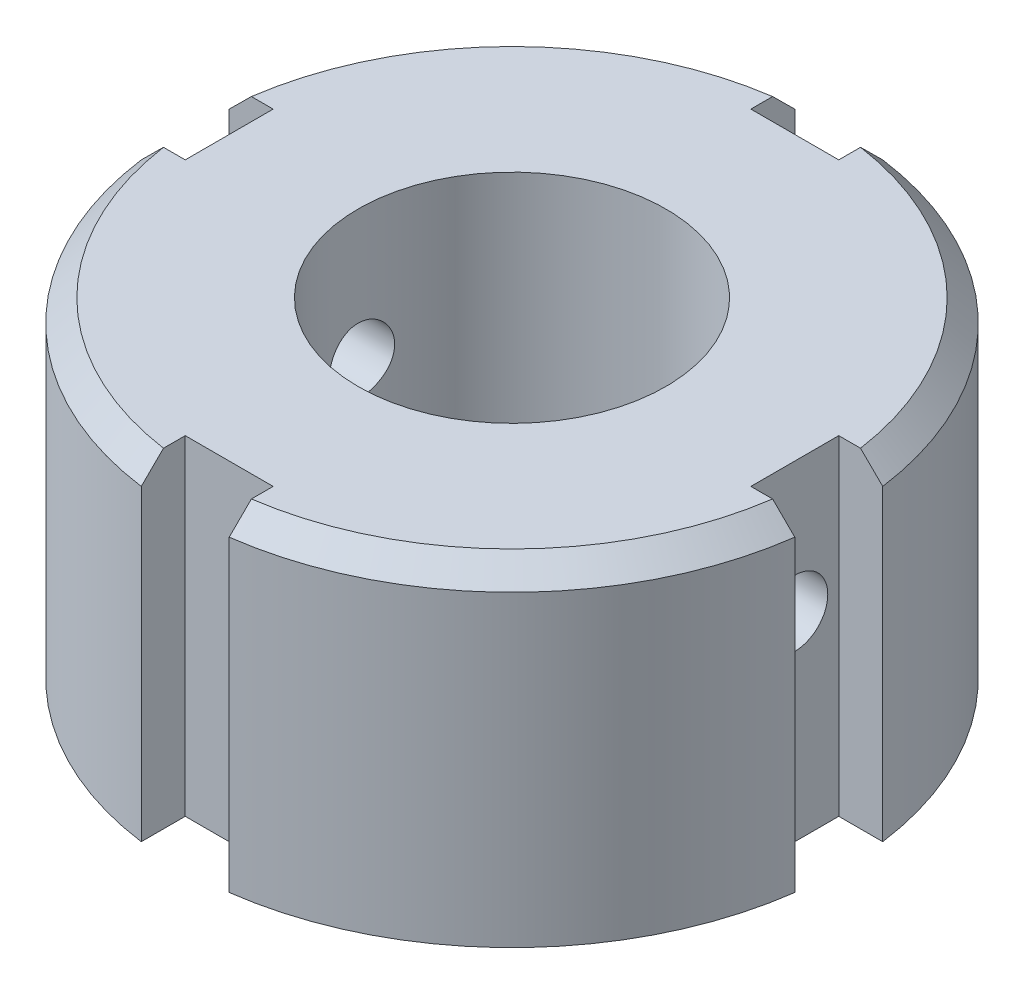
ISO-10303-21;
HEADER;
FILE_DESCRIPTION(('STEP AP214'),'2;1');
FILE_NAME('part.step','',(''),(''),'','','');
FILE_SCHEMA(('AUTOMOTIVE_DESIGN { 1 0 10303 214 1 1 1 1 }'));
ENDSEC;
DATA;
#1=APPLICATION_CONTEXT('core data for automotive mechanical design processes');
#2=APPLICATION_PROTOCOL_DEFINITION('international standard','automotive_design',2000,#1);
#3=PRODUCT_CONTEXT('',#1,'mechanical');
#4=PRODUCT('Part','Part','',(#3));
#5=PRODUCT_RELATED_PRODUCT_CATEGORY('part','',(#4));
#6=PRODUCT_DEFINITION_FORMATION('','',#4);
#7=PRODUCT_DEFINITION_CONTEXT('part definition',#1,'design');
#8=PRODUCT_DEFINITION('design','',#6,#7);
#9=PRODUCT_DEFINITION_SHAPE('','',#8);
#10=(LENGTH_UNIT() NAMED_UNIT(*) SI_UNIT(.MILLI.,.METRE.));
#11=(NAMED_UNIT(*) PLANE_ANGLE_UNIT() SI_UNIT($,.RADIAN.));
#12=(NAMED_UNIT(*) SI_UNIT($,.STERADIAN.) SOLID_ANGLE_UNIT());
#13=UNCERTAINTY_MEASURE_WITH_UNIT(LENGTH_MEASURE(1.E-05),#10,'distance_accuracy_value','');
#14=(GEOMETRIC_REPRESENTATION_CONTEXT(3) GLOBAL_UNCERTAINTY_ASSIGNED_CONTEXT((#13)) GLOBAL_UNIT_ASSIGNED_CONTEXT((#10,
#11,#12)) REPRESENTATION_CONTEXT('',''));
#15=CARTESIAN_POINT('',(0.,0.,0.));
#16=DIRECTION('',(0.,0.,1.));
#17=DIRECTION('',(1.,0.,0.));
#18=AXIS2_PLACEMENT_3D('',#15,#16,#17);
#19=CARTESIAN_POINT('',(0.,7.5,0.));
#20=DIRECTION('',(0.,-1.,0.));
#21=DIRECTION('',(0.,0.,-1.));
#22=AXIS2_PLACEMENT_3D('',#19,#20,#21);
#23=CYLINDRICAL_SURFACE('',#22,15.);
#24=DIRECTION('',(0.,1.,0.));
#25=VECTOR('',#24,1.);
#26=CARTESIAN_POINT('',(2.00000000000001,-7.5,-14.8660687473185));
#27=LINE('',#26,#25);
#28=CARTESIAN_POINT('',(2.00000000000001,-7.5,-14.8660687473185));
#29=VERTEX_POINT('',#28);
#30=CARTESIAN_POINT('',(2.00000000000001,6.5,-14.8660687473185));
#31=VERTEX_POINT('',#30);
#32=EDGE_CURVE('E226',#29,#31,#27,.T.);
#33=ORIENTED_EDGE('',*,*,#32,.T.);
#34=CARTESIAN_POINT('',(0.,6.5,0.));
#35=DIRECTION('',(0.,1.,0.));
#36=DIRECTION('',(0.,0.,1.));
#37=AXIS2_PLACEMENT_3D('',#34,#35,#36);
#38=CIRCLE('',#37,15.);
#39=CARTESIAN_POINT('',(14.8660687473185,6.5,-2.));
#40=VERTEX_POINT('',#39);
#41=EDGE_CURVE('E373',#31,#40,#38,.F.);
#42=ORIENTED_EDGE('',*,*,#41,.T.);
#43=DIRECTION('',(0.,1.,0.));
#44=VECTOR('',#43,1.);
#45=CARTESIAN_POINT('',(14.8660687473185,-7.5,-2.));
#46=LINE('',#45,#44);
#47=CARTESIAN_POINT('',(14.8660687473185,-7.5,-2.));
#48=VERTEX_POINT('',#47);
#49=EDGE_CURVE('E232',#48,#40,#46,.T.);
#50=ORIENTED_EDGE('',*,*,#49,.F.);
#51=CARTESIAN_POINT('',(0.,-7.5,0.));
#52=DIRECTION('',(0.,1.,0.));
#53=DIRECTION('',(0.,0.,1.));
#54=AXIS2_PLACEMENT_3D('',#51,#52,#53);
#55=CIRCLE('',#54,15.);
#56=EDGE_CURVE('E317',#48,#29,#55,.T.);
#57=ORIENTED_EDGE('',*,*,#56,.T.);
#58=EDGE_LOOP('',(#33,#42,#50,#57));
#59=FACE_BOUND('',#58,.T.);
#60=ADVANCED_FACE('F43',(#59),#23,.T.);
#61=DIRECTION('',(0.,1.,0.));
#62=VECTOR('',#61,1.);
#63=CARTESIAN_POINT('',(14.8660687473185,-7.5,2.00000000000001));
#64=LINE('',#63,#62);
#65=CARTESIAN_POINT('',(14.8660687473185,-7.5,2.00000000000001));
#66=VERTEX_POINT('',#65);
#67=CARTESIAN_POINT('',(14.8660687473185,6.5,2.00000000000001));
#68=VERTEX_POINT('',#67);
#69=EDGE_CURVE('E241',#66,#68,#64,.T.);
#70=ORIENTED_EDGE('',*,*,#69,.T.);
#71=CARTESIAN_POINT('',(0.,6.5,0.));
#72=DIRECTION('',(0.,1.,0.));
#73=DIRECTION('',(0.,0.,1.));
#74=AXIS2_PLACEMENT_3D('',#71,#72,#73);
#75=CIRCLE('',#74,15.);
#76=CARTESIAN_POINT('',(2.,6.5,14.8660687473185));
#77=VERTEX_POINT('',#76);
#78=EDGE_CURVE('E437',#68,#77,#75,.F.);
#79=ORIENTED_EDGE('',*,*,#78,.T.);
#80=DIRECTION('',(0.,1.,0.));
#81=VECTOR('',#80,1.);
#82=CARTESIAN_POINT('',(2.,-7.5,14.8660687473185));
#83=LINE('',#82,#81);
#84=CARTESIAN_POINT('',(2.,-7.5,14.8660687473185));
#85=VERTEX_POINT('',#84);
#86=EDGE_CURVE('E260',#85,#77,#83,.T.);
#87=ORIENTED_EDGE('',*,*,#86,.F.);
#88=EDGE_CURVE('E313',#85,#66,#55,.T.);
#89=ORIENTED_EDGE('',*,*,#88,.T.);
#90=EDGE_LOOP('',(#70,#79,#87,#89));
#91=FACE_BOUND('',#90,.T.);
#92=ADVANCED_FACE('F363',(#91),#23,.T.);
#93=DIRECTION('',(0.,1.,0.));
#94=VECTOR('',#93,1.);
#95=CARTESIAN_POINT('',(-2.00000000000001,-7.5,14.8660687473185));
#96=LINE('',#95,#94);
#97=CARTESIAN_POINT('',(-2.00000000000001,-7.5,14.8660687473185));
#98=VERTEX_POINT('',#97);
#99=CARTESIAN_POINT('',(-2.00000000000001,6.49999999999999,14.8660687473185));
#100=VERTEX_POINT('',#99);
#101=EDGE_CURVE('E269',#98,#100,#96,.T.);
#102=ORIENTED_EDGE('',*,*,#101,.T.);
#103=CARTESIAN_POINT('',(0.,6.49999999999999,0.));
#104=DIRECTION('',(0.,1.,0.));
#105=DIRECTION('',(0.,0.,1.));
#106=AXIS2_PLACEMENT_3D('',#103,#104,#105);
#107=CIRCLE('',#106,15.);
#108=CARTESIAN_POINT('',(-14.8660687473185,6.49999999999999,2.));
#109=VERTEX_POINT('',#108);
#110=EDGE_CURVE('E59',#100,#109,#107,.F.);
#111=ORIENTED_EDGE('',*,*,#110,.T.);
#112=DIRECTION('',(0.,1.,0.));
#113=VECTOR('',#112,1.);
#114=CARTESIAN_POINT('',(-14.8660687473185,-7.5,2.));
#115=LINE('',#114,#113);
#116=CARTESIAN_POINT('',(-14.8660687473185,-7.5,2.));
#117=VERTEX_POINT('',#116);
#118=EDGE_CURVE('E286',#117,#109,#115,.T.);
#119=ORIENTED_EDGE('',*,*,#118,.F.);
#120=EDGE_CURVE('E229',#117,#98,#55,.T.);
#121=ORIENTED_EDGE('',*,*,#120,.T.);
#122=EDGE_LOOP('',(#102,#111,#119,#121));
#123=FACE_BOUND('',#122,.T.);
#124=ADVANCED_FACE('F358',(#123),#23,.T.);
#125=DIRECTION('',(0.,1.,0.));
#126=VECTOR('',#125,1.);
#127=CARTESIAN_POINT('',(-14.8660687473185,-7.5,-2.00000000000001));
#128=LINE('',#127,#126);
#129=CARTESIAN_POINT('',(-14.8660687473185,-7.5,-2.00000000000001));
#130=VERTEX_POINT('',#129);
#131=CARTESIAN_POINT('',(-14.8660687473185,6.5,-2.00000000000001));
#132=VERTEX_POINT('',#131);
#133=EDGE_CURVE('E294',#130,#132,#128,.T.);
#134=ORIENTED_EDGE('',*,*,#133,.T.);
#135=CARTESIAN_POINT('',(0.,6.5,0.));
#136=DIRECTION('',(0.,1.,0.));
#137=DIRECTION('',(0.,0.,1.));
#138=AXIS2_PLACEMENT_3D('',#135,#136,#137);
#139=CIRCLE('',#138,15.);
#140=CARTESIAN_POINT('',(-2.,6.5,-14.8660687473185));
#141=VERTEX_POINT('',#140);
#142=EDGE_CURVE('E335',#132,#141,#139,.F.);
#143=ORIENTED_EDGE('',*,*,#142,.T.);
#144=DIRECTION('',(0.,1.,0.));
#145=VECTOR('',#144,1.);
#146=CARTESIAN_POINT('',(-2.,-7.5,-14.8660687473185));
#147=LINE('',#146,#145);
#148=CARTESIAN_POINT('',(-2.,-7.5,-14.8660687473185));
#149=VERTEX_POINT('',#148);
#150=EDGE_CURVE('E210',#149,#141,#147,.T.);
#151=ORIENTED_EDGE('',*,*,#150,.F.);
#152=EDGE_CURVE('E475',#149,#130,#55,.T.);
#153=ORIENTED_EDGE('',*,*,#152,.T.);
#154=EDGE_LOOP('',(#134,#143,#151,#153));
#155=FACE_BOUND('',#154,.T.);
#156=ADVANCED_FACE('F353',(#155),#23,.T.);
#157=CARTESIAN_POINT('',(0.,7.5,0.));
#158=DIRECTION('',(0.,1.,0.));
#159=DIRECTION('',(0.,0.,1.));
#160=AXIS2_PLACEMENT_3D('',#157,#158,#159);
#161=PLANE('',#160);
#162=CARTESIAN_POINT('',(0.,7.5,0.));
#163=DIRECTION('',(0.,1.,0.));
#164=DIRECTION('',(0.,0.,1.));
#165=AXIS2_PLACEMENT_3D('',#162,#163,#164);
#166=CIRCLE('',#165,7.);
#167=CARTESIAN_POINT('',(0.,7.5,7.));
#168=VERTEX_POINT('',#167);
#169=EDGE_CURVE('E518',#168,#168,#166,.T.);
#170=ORIENTED_EDGE('',*,*,#169,.F.);
#171=EDGE_LOOP('',(#170));
#172=FACE_BOUND('',#171,.T.);
#173=DIRECTION('',(0.,0.,1.));
#174=VECTOR('',#173,1.);
#175=CARTESIAN_POINT('',(-2.,7.5,-14.8660687473185));
#176=LINE('',#175,#174);
#177=CARTESIAN_POINT('',(-2.,7.5,-13.856406460551));
#178=VERTEX_POINT('',#177);
#179=CARTESIAN_POINT('',(-2.,7.5,-12.8660687473185));
#180=VERTEX_POINT('',#179);
#181=EDGE_CURVE('E188',#178,#180,#176,.T.);
#182=ORIENTED_EDGE('',*,*,#181,.F.);
#183=CARTESIAN_POINT('',(0.,7.5,0.));
#184=DIRECTION('',(0.,1.,0.));
#185=DIRECTION('',(0.,0.,1.));
#186=AXIS2_PLACEMENT_3D('',#183,#184,#185);
#187=CIRCLE('',#186,14.);
#188=CARTESIAN_POINT('',(-13.856406460551,7.5,-2.00000000000001));
#189=VERTEX_POINT('',#188);
#190=EDGE_CURVE('E325',#178,#189,#187,.T.);
#191=ORIENTED_EDGE('',*,*,#190,.T.);
#192=DIRECTION('',(-1.,0.,0.));
#193=VECTOR('',#192,1.);
#194=CARTESIAN_POINT('',(-12.8660687473185,7.5,-2.00000000000001));
#195=LINE('',#194,#193);
#196=CARTESIAN_POINT('',(-12.8660687473185,7.5,-2.00000000000001));
#197=VERTEX_POINT('',#196);
#198=EDGE_CURVE('E306',#197,#189,#195,.T.);
#199=ORIENTED_EDGE('',*,*,#198,.F.);
#200=DIRECTION('',(0.,0.,-1.));
#201=VECTOR('',#200,1.);
#202=CARTESIAN_POINT('',(-12.8660687473185,7.5,2.));
#203=LINE('',#202,#201);
#204=CARTESIAN_POINT('',(-12.8660687473185,7.5,2.));
#205=VERTEX_POINT('',#204);
#206=EDGE_CURVE('E309',#205,#197,#203,.T.);
#207=ORIENTED_EDGE('',*,*,#206,.F.);
#208=DIRECTION('',(1.,0.,0.));
#209=VECTOR('',#208,1.);
#210=CARTESIAN_POINT('',(-14.8660687473185,7.5,2.));
#211=LINE('',#210,#209);
#212=CARTESIAN_POINT('',(-13.856406460551,7.5,2.));
#213=VERTEX_POINT('',#212);
#214=EDGE_CURVE('E271',#213,#205,#211,.T.);
#215=ORIENTED_EDGE('',*,*,#214,.F.);
#216=CARTESIAN_POINT('',(0.,7.5,0.));
#217=DIRECTION('',(0.,1.,0.));
#218=DIRECTION('',(0.,0.,1.));
#219=AXIS2_PLACEMENT_3D('',#216,#217,#218);
#220=CIRCLE('',#219,14.);
#221=CARTESIAN_POINT('',(-2.00000000000001,7.5,13.856406460551));
#222=VERTEX_POINT('',#221);
#223=EDGE_CURVE('E316',#213,#222,#220,.T.);
#224=ORIENTED_EDGE('',*,*,#223,.T.);
#225=DIRECTION('',(0.,0.,1.));
#226=VECTOR('',#225,1.);
#227=CARTESIAN_POINT('',(-2.00000000000001,7.5,12.8660687473185));
#228=LINE('',#227,#226);
#229=CARTESIAN_POINT('',(-2.00000000000001,7.5,12.8660687473185));
#230=VERTEX_POINT('',#229);
#231=EDGE_CURVE('E280',#230,#222,#228,.T.);
#232=ORIENTED_EDGE('',*,*,#231,.F.);
#233=DIRECTION('',(-1.,0.,0.));
#234=VECTOR('',#233,1.);
#235=CARTESIAN_POINT('',(2.,7.5,12.8660687473185));
#236=LINE('',#235,#234);
#237=CARTESIAN_POINT('',(2.,7.5,12.8660687473185));
#238=VERTEX_POINT('',#237);
#239=EDGE_CURVE('E282',#238,#230,#236,.T.);
#240=ORIENTED_EDGE('',*,*,#239,.F.);
#241=DIRECTION('',(0.,0.,-1.));
#242=VECTOR('',#241,1.);
#243=CARTESIAN_POINT('',(2.,7.5,14.8660687473185));
#244=LINE('',#243,#242);
#245=CARTESIAN_POINT('',(2.,7.5,13.856406460551));
#246=VERTEX_POINT('',#245);
#247=EDGE_CURVE('E244',#246,#238,#244,.T.);
#248=ORIENTED_EDGE('',*,*,#247,.F.);
#249=CARTESIAN_POINT('',(0.,7.5,0.));
#250=DIRECTION('',(0.,1.,0.));
#251=DIRECTION('',(0.,0.,1.));
#252=AXIS2_PLACEMENT_3D('',#249,#250,#251);
#253=CIRCLE('',#252,14.);
#254=CARTESIAN_POINT('',(13.856406460551,7.5,2.00000000000001));
#255=VERTEX_POINT('',#254);
#256=EDGE_CURVE('E320',#246,#255,#253,.T.);
#257=ORIENTED_EDGE('',*,*,#256,.T.);
#258=DIRECTION('',(1.,0.,0.));
#259=VECTOR('',#258,1.);
#260=CARTESIAN_POINT('',(12.8660687473185,7.5,2.00000000000001));
#261=LINE('',#260,#259);
#262=CARTESIAN_POINT('',(12.8660687473185,7.5,2.00000000000001));
#263=VERTEX_POINT('',#262);
#264=EDGE_CURVE('E253',#263,#255,#261,.T.);
#265=ORIENTED_EDGE('',*,*,#264,.F.);
#266=DIRECTION('',(0.,0.,1.));
#267=VECTOR('',#266,1.);
#268=CARTESIAN_POINT('',(12.8660687473185,7.5,-2.));
#269=LINE('',#268,#267);
#270=CARTESIAN_POINT('',(12.8660687473185,7.5,-2.));
#271=VERTEX_POINT('',#270);
#272=EDGE_CURVE('E256',#271,#263,#269,.T.);
#273=ORIENTED_EDGE('',*,*,#272,.F.);
#274=DIRECTION('',(-1.,0.,0.));
#275=VECTOR('',#274,1.);
#276=CARTESIAN_POINT('',(14.8660687473185,7.5,-2.));
#277=LINE('',#276,#275);
#278=CARTESIAN_POINT('',(13.856406460551,7.5,-2.));
#279=VERTEX_POINT('',#278);
#280=EDGE_CURVE('E201',#279,#271,#277,.T.);
#281=ORIENTED_EDGE('',*,*,#280,.F.);
#282=CARTESIAN_POINT('',(0.,7.5,0.));
#283=DIRECTION('',(0.,1.,0.));
#284=DIRECTION('',(0.,0.,1.));
#285=AXIS2_PLACEMENT_3D('',#282,#283,#284);
#286=CIRCLE('',#285,14.);
#287=CARTESIAN_POINT('',(2.00000000000001,7.5,-13.856406460551));
#288=VERTEX_POINT('',#287);
#289=EDGE_CURVE('E323',#279,#288,#286,.T.);
#290=ORIENTED_EDGE('',*,*,#289,.T.);
#291=DIRECTION('',(0.,0.,-1.));
#292=VECTOR('',#291,1.);
#293=CARTESIAN_POINT('',(2.00000000000001,7.5,-12.8660687473185));
#294=LINE('',#293,#292);
#295=CARTESIAN_POINT('',(2.00000000000001,7.5,-12.8660687473185));
#296=VERTEX_POINT('',#295);
#297=EDGE_CURVE('E215',#296,#288,#294,.T.);
#298=ORIENTED_EDGE('',*,*,#297,.F.);
#299=DIRECTION('',(1.,0.,0.));
#300=VECTOR('',#299,1.);
#301=CARTESIAN_POINT('',(-2.,7.5,-12.8660687473185));
#302=LINE('',#301,#300);
#303=EDGE_CURVE('E200',#180,#296,#302,.T.);
#304=ORIENTED_EDGE('',*,*,#303,.F.);
#305=EDGE_LOOP('',(#182,#191,#199,#207,#215,#224,#232,#240,#248,#257,#265,#273,#281,#290,#298,#304));
#306=FACE_BOUND('',#305,.T.);
#307=ADVANCED_FACE('F212',(#172,#306),#161,.T.);
#308=CARTESIAN_POINT('',(0.,-7.5,0.));
#309=DIRECTION('',(0.,1.,0.));
#310=DIRECTION('',(0.,0.,1.));
#311=AXIS2_PLACEMENT_3D('',#308,#309,#310);
#312=PLANE('',#311);
#313=CARTESIAN_POINT('',(0.,-7.5,0.));
#314=DIRECTION('',(0.,1.,0.));
#315=DIRECTION('',(0.,0.,1.));
#316=AXIS2_PLACEMENT_3D('',#313,#314,#315);
#317=CIRCLE('',#316,7.);
#318=CARTESIAN_POINT('',(0.,-7.5,7.));
#319=VERTEX_POINT('',#318);
#320=EDGE_CURVE('E297',#319,#319,#317,.T.);
#321=ORIENTED_EDGE('',*,*,#320,.T.);
#322=EDGE_LOOP('',(#321));
#323=FACE_BOUND('',#322,.T.);
#324=DIRECTION('',(1.,0.,0.));
#325=VECTOR('',#324,1.);
#326=CARTESIAN_POINT('',(-2.,-7.5,-12.8660687473185));
#327=LINE('',#326,#325);
#328=CARTESIAN_POINT('',(-2.,-7.5,-12.8660687473185));
#329=VERTEX_POINT('',#328);
#330=CARTESIAN_POINT('',(2.00000000000001,-7.5,-12.8660687473185));
#331=VERTEX_POINT('',#330);
#332=EDGE_CURVE('E208',#329,#331,#327,.T.);
#333=ORIENTED_EDGE('',*,*,#332,.T.);
#334=DIRECTION('',(0.,0.,-1.));
#335=VECTOR('',#334,1.);
#336=CARTESIAN_POINT('',(2.00000000000001,-7.5,-12.8660687473185));
#337=LINE('',#336,#335);
#338=EDGE_CURVE('E223',#331,#29,#337,.T.);
#339=ORIENTED_EDGE('',*,*,#338,.T.);
#340=ORIENTED_EDGE('',*,*,#56,.F.);
#341=DIRECTION('',(-1.,0.,0.));
#342=VECTOR('',#341,1.);
#343=CARTESIAN_POINT('',(14.8660687473185,-7.5,-2.));
#344=LINE('',#343,#342);
#345=CARTESIAN_POINT('',(12.8660687473185,-7.5,-2.));
#346=VERTEX_POINT('',#345);
#347=EDGE_CURVE('E250',#48,#346,#344,.T.);
#348=ORIENTED_EDGE('',*,*,#347,.T.);
#349=DIRECTION('',(0.,0.,1.));
#350=VECTOR('',#349,1.);
#351=CARTESIAN_POINT('',(12.8660687473185,-7.5,-2.));
#352=LINE('',#351,#350);
#353=CARTESIAN_POINT('',(12.8660687473185,-7.5,2.00000000000001));
#354=VERTEX_POINT('',#353);
#355=EDGE_CURVE('E247',#346,#354,#352,.T.);
#356=ORIENTED_EDGE('',*,*,#355,.T.);
#357=DIRECTION('',(1.,0.,0.));
#358=VECTOR('',#357,1.);
#359=CARTESIAN_POINT('',(12.8660687473185,-7.5,2.00000000000001));
#360=LINE('',#359,#358);
#361=EDGE_CURVE('E235',#354,#66,#360,.T.);
#362=ORIENTED_EDGE('',*,*,#361,.T.);
#363=ORIENTED_EDGE('',*,*,#88,.F.);
#364=DIRECTION('',(0.,0.,-1.));
#365=VECTOR('',#364,1.);
#366=CARTESIAN_POINT('',(2.,-7.5,14.8660687473185));
#367=LINE('',#366,#365);
#368=CARTESIAN_POINT('',(2.,-7.5,12.8660687473185));
#369=VERTEX_POINT('',#368);
#370=EDGE_CURVE('E277',#85,#369,#367,.T.);
#371=ORIENTED_EDGE('',*,*,#370,.T.);
#372=DIRECTION('',(-1.,0.,0.));
#373=VECTOR('',#372,1.);
#374=CARTESIAN_POINT('',(2.,-7.5,12.8660687473185));
#375=LINE('',#374,#373);
#376=CARTESIAN_POINT('',(-2.00000000000001,-7.5,12.8660687473185));
#377=VERTEX_POINT('',#376);
#378=EDGE_CURVE('E274',#369,#377,#375,.T.);
#379=ORIENTED_EDGE('',*,*,#378,.T.);
#380=DIRECTION('',(0.,0.,1.));
#381=VECTOR('',#380,1.);
#382=CARTESIAN_POINT('',(-2.00000000000001,-7.5,12.8660687473185));
#383=LINE('',#382,#381);
#384=EDGE_CURVE('E263',#377,#98,#383,.T.);
#385=ORIENTED_EDGE('',*,*,#384,.T.);
#386=ORIENTED_EDGE('',*,*,#120,.F.);
#387=DIRECTION('',(1.,0.,0.));
#388=VECTOR('',#387,1.);
#389=CARTESIAN_POINT('',(-14.8660687473185,-7.5,2.));
#390=LINE('',#389,#388);
#391=CARTESIAN_POINT('',(-12.8660687473185,-7.5,2.));
#392=VERTEX_POINT('',#391);
#393=EDGE_CURVE('E303',#117,#392,#390,.T.);
#394=ORIENTED_EDGE('',*,*,#393,.T.);
#395=DIRECTION('',(0.,0.,-1.));
#396=VECTOR('',#395,1.);
#397=CARTESIAN_POINT('',(-12.8660687473185,-7.5,2.));
#398=LINE('',#397,#396);
#399=CARTESIAN_POINT('',(-12.8660687473185,-7.5,-2.00000000000001));
#400=VERTEX_POINT('',#399);
#401=EDGE_CURVE('E300',#392,#400,#398,.T.);
#402=ORIENTED_EDGE('',*,*,#401,.T.);
#403=DIRECTION('',(-1.,0.,0.));
#404=VECTOR('',#403,1.);
#405=CARTESIAN_POINT('',(-12.8660687473185,-7.5,-2.00000000000001));
#406=LINE('',#405,#404);
#407=EDGE_CURVE('E288',#400,#130,#406,.T.);
#408=ORIENTED_EDGE('',*,*,#407,.T.);
#409=ORIENTED_EDGE('',*,*,#152,.F.);
#410=DIRECTION('',(0.,0.,1.));
#411=VECTOR('',#410,1.);
#412=CARTESIAN_POINT('',(-2.,-7.5,-14.8660687473185));
#413=LINE('',#412,#411);
#414=EDGE_CURVE('E217',#149,#329,#413,.T.);
#415=ORIENTED_EDGE('',*,*,#414,.T.);
#416=EDGE_LOOP('',(#333,#339,#340,#348,#356,#362,#363,#371,#379,#385,#386,#394,#402,#408,#409,#415));
#417=FACE_BOUND('',#416,.T.);
#418=ADVANCED_FACE('F348',(#323,#417),#312,.F.);
#419=CARTESIAN_POINT('',(-12.8660687473185,-7.5,-2.00000000000001));
#420=DIRECTION('',(0.,0.,-1.));
#421=DIRECTION('',(-1.,0.,0.));
#422=AXIS2_PLACEMENT_3D('',#419,#420,#421);
#423=PLANE('',#422);
#424=ORIENTED_EDGE('',*,*,#198,.T.);
#425=CARTESIAN_POINT('',(-13.856406460551,7.5,-2.00000000000001));
#426=CARTESIAN_POINT('',(-14.0247393045907,7.33338966837254,-2.00000000000001));
#427=CARTESIAN_POINT('',(-14.1930442505891,7.16675116914493,-2.00000000000001));
#428=CARTESIAN_POINT('',(-14.5295983461781,6.83341783581149,-2.00000000000001));
#429=CARTESIAN_POINT('',(-14.6978474957689,6.66672300170576,-2.00000000000001));
#430=CARTESIAN_POINT('',(-14.8660687473185,6.5,-2.00000000000001));
#431=B_SPLINE_CURVE_WITH_KNOTS('',3,(#425,#426,#427,#428,#429,#430),.UNSPECIFIED.,.F.,.F.,(4,2,
4),(0.,0.710531138269904,1.42106227516681),.UNSPECIFIED.);
#432=EDGE_CURVE('E327',#189,#132,#431,.T.);
#433=ORIENTED_EDGE('',*,*,#432,.T.);
#434=ORIENTED_EDGE('',*,*,#133,.F.);
#435=ORIENTED_EDGE('',*,*,#407,.F.);
#436=DIRECTION('',(0.,1.,0.));
#437=VECTOR('',#436,1.);
#438=CARTESIAN_POINT('',(-12.8660687473185,-7.5,-2.00000000000001));
#439=LINE('',#438,#437);
#440=EDGE_CURVE('E292',#400,#197,#439,.T.);
#441=ORIENTED_EDGE('',*,*,#440,.T.);
#442=EDGE_LOOP('',(#424,#433,#434,#435,#441));
#443=FACE_BOUND('',#442,.T.);
#444=ADVANCED_FACE('F342',(#443),#423,.F.);
#445=CARTESIAN_POINT('',(-12.8660687473185,-7.5,2.));
#446=DIRECTION('',(1.,0.,0.));
#447=DIRECTION('',(0.,0.,-1.));
#448=AXIS2_PLACEMENT_3D('',#445,#446,#447);
#449=PLANE('',#448);
#450=CARTESIAN_POINT('',(-12.8660687473185,1.5,0.));
#451=DIRECTION('',(1.,0.,0.));
#452=DIRECTION('',(0.,0.,-1.));
#453=AXIS2_PLACEMENT_3D('',#450,#451,#452);
#454=CIRCLE('',#453,1.5);
#455=CARTESIAN_POINT('',(-12.8660687473185,1.5,-1.50000000000001));
#456=VERTEX_POINT('',#455);
#457=EDGE_CURVE('E516',#456,#456,#454,.T.);
#458=ORIENTED_EDGE('',*,*,#457,.T.);
#459=EDGE_LOOP('',(#458));
#460=FACE_BOUND('',#459,.T.);
#461=ORIENTED_EDGE('',*,*,#440,.F.);
#462=ORIENTED_EDGE('',*,*,#401,.F.);
#463=DIRECTION('',(0.,1.,0.));
#464=VECTOR('',#463,1.);
#465=CARTESIAN_POINT('',(-12.8660687473185,-7.5,2.));
#466=LINE('',#465,#464);
#467=EDGE_CURVE('E289',#392,#205,#466,.T.);
#468=ORIENTED_EDGE('',*,*,#467,.T.);
#469=ORIENTED_EDGE('',*,*,#206,.T.);
#470=EDGE_LOOP('',(#461,#462,#468,#469));
#471=FACE_BOUND('',#470,.T.);
#472=ADVANCED_FACE('F347',(#460,#471),#449,.F.);
#473=CARTESIAN_POINT('',(-14.8660687473185,-7.5,2.));
#474=DIRECTION('',(0.,0.,1.));
#475=DIRECTION('',(1.,0.,0.));
#476=AXIS2_PLACEMENT_3D('',#473,#474,#475);
#477=PLANE('',#476);
#478=ORIENTED_EDGE('',*,*,#118,.T.);
#479=CARTESIAN_POINT('',(-14.8660687473185,6.49999999999999,2.));
#480=CARTESIAN_POINT('',(-14.6978474957689,6.66672300170576,2.));
#481=CARTESIAN_POINT('',(-14.5295983461781,6.83341783581148,2.));
#482=CARTESIAN_POINT('',(-14.193044250589,7.16675116914493,2.));
#483=CARTESIAN_POINT('',(-14.0247393045907,7.33338966837254,2.));
#484=CARTESIAN_POINT('',(-13.856406460551,7.5,2.));
#485=B_SPLINE_CURVE_WITH_KNOTS('',3,(#479,#480,#481,#482,#483,#484),.UNSPECIFIED.,.F.,.F.,(4,2,
4),(0.,0.71053113689691,1.42106227516682),.UNSPECIFIED.);
#486=EDGE_CURVE('E11',#109,#213,#485,.T.);
#487=ORIENTED_EDGE('',*,*,#486,.T.);
#488=ORIENTED_EDGE('',*,*,#214,.T.);
#489=ORIENTED_EDGE('',*,*,#467,.F.);
#490=ORIENTED_EDGE('',*,*,#393,.F.);
#491=EDGE_LOOP('',(#478,#487,#488,#489,#490));
#492=FACE_BOUND('',#491,.T.);
#493=ADVANCED_FACE('F483',(#492),#477,.F.);
#494=CARTESIAN_POINT('',(-2.00000000000001,-7.5,12.8660687473185));
#495=DIRECTION('',(-1.,0.,0.));
#496=DIRECTION('',(0.,0.,1.));
#497=AXIS2_PLACEMENT_3D('',#494,#495,#496);
#498=PLANE('',#497);
#499=ORIENTED_EDGE('',*,*,#231,.T.);
#500=CARTESIAN_POINT('',(-2.00000000000001,7.5,13.856406460551));
#501=CARTESIAN_POINT('',(-2.00000000000001,7.33338966837254,14.0247393045907));
#502=CARTESIAN_POINT('',(-2.00000000000001,7.16675116914493,14.193044250589));
#503=CARTESIAN_POINT('',(-2.00000000000001,6.83341783581149,14.5295983461781));
#504=CARTESIAN_POINT('',(-2.00000000000001,6.66672300170576,14.6978474957689));
#505=CARTESIAN_POINT('',(-2.00000000000001,6.49999999999999,14.8660687473185));
#506=B_SPLINE_CURVE_WITH_KNOTS('',3,(#500,#501,#502,#503,#504,#505),.UNSPECIFIED.,.F.,.F.,(4,2,
4),(0.,0.710531138269907,1.42106227516682),.UNSPECIFIED.);
#507=EDGE_CURVE('E74',#222,#100,#506,.T.);
#508=ORIENTED_EDGE('',*,*,#507,.T.);
#509=ORIENTED_EDGE('',*,*,#101,.F.);
#510=ORIENTED_EDGE('',*,*,#384,.F.);
#511=DIRECTION('',(0.,1.,0.));
#512=VECTOR('',#511,1.);
#513=CARTESIAN_POINT('',(-2.00000000000001,-7.5,12.8660687473185));
#514=LINE('',#513,#512);
#515=EDGE_CURVE('E267',#377,#230,#514,.T.);
#516=ORIENTED_EDGE('',*,*,#515,.T.);
#517=EDGE_LOOP('',(#499,#508,#509,#510,#516));
#518=FACE_BOUND('',#517,.T.);
#519=ADVANCED_FACE('F481',(#518),#498,.F.);
#520=CARTESIAN_POINT('',(2.,-7.5,12.8660687473185));
#521=DIRECTION('',(0.,0.,-1.));
#522=DIRECTION('',(-1.,0.,0.));
#523=AXIS2_PLACEMENT_3D('',#520,#521,#522);
#524=PLANE('',#523);
#525=ORIENTED_EDGE('',*,*,#515,.F.);
#526=ORIENTED_EDGE('',*,*,#378,.F.);
#527=DIRECTION('',(0.,1.,0.));
#528=VECTOR('',#527,1.);
#529=CARTESIAN_POINT('',(2.,-7.5,12.8660687473185));
#530=LINE('',#529,#528);
#531=EDGE_CURVE('E264',#369,#238,#530,.T.);
#532=ORIENTED_EDGE('',*,*,#531,.T.);
#533=ORIENTED_EDGE('',*,*,#239,.T.);
#534=EDGE_LOOP('',(#525,#526,#532,#533));
#535=FACE_BOUND('',#534,.T.);
#536=ADVANCED_FACE('F427',(#535),#524,.F.);
#537=CARTESIAN_POINT('',(2.,-7.5,14.8660687473185));
#538=DIRECTION('',(1.,0.,0.));
#539=DIRECTION('',(0.,0.,-1.));
#540=AXIS2_PLACEMENT_3D('',#537,#538,#539);
#541=PLANE('',#540);
#542=ORIENTED_EDGE('',*,*,#86,.T.);
#543=CARTESIAN_POINT('',(2.,6.5,14.8660687473185));
#544=CARTESIAN_POINT('',(2.,6.66672300170576,14.6978474957689));
#545=CARTESIAN_POINT('',(2.,6.83341783581149,14.5295983461781));
#546=CARTESIAN_POINT('',(2.,7.16675116914493,14.1930442505891));
#547=CARTESIAN_POINT('',(2.,7.33338966837254,14.0247393045907));
#548=CARTESIAN_POINT('',(2.,7.5,13.856406460551));
#549=B_SPLINE_CURVE_WITH_KNOTS('',3,(#543,#544,#545,#546,#547,#548),.UNSPECIFIED.,.F.,.F.,(4,2,
4),(0.,0.710531136896908,1.42106227516681),.UNSPECIFIED.);
#550=EDGE_CURVE('E431',#77,#246,#549,.T.);
#551=ORIENTED_EDGE('',*,*,#550,.T.);
#552=ORIENTED_EDGE('',*,*,#247,.T.);
#553=ORIENTED_EDGE('',*,*,#531,.F.);
#554=ORIENTED_EDGE('',*,*,#370,.F.);
#555=EDGE_LOOP('',(#542,#551,#552,#553,#554));
#556=FACE_BOUND('',#555,.T.);
#557=ADVANCED_FACE('F422',(#556),#541,.F.);
#558=CARTESIAN_POINT('',(12.8660687473185,-7.5,2.00000000000001));
#559=DIRECTION('',(0.,0.,1.));
#560=DIRECTION('',(1.,0.,0.));
#561=AXIS2_PLACEMENT_3D('',#558,#559,#560);
#562=PLANE('',#561);
#563=ORIENTED_EDGE('',*,*,#264,.T.);
#564=CARTESIAN_POINT('',(13.856406460551,7.5,2.00000000000001));
#565=CARTESIAN_POINT('',(14.0247393045907,7.33338966837254,2.00000000000001));
#566=CARTESIAN_POINT('',(14.1930442505891,7.16675116914493,2.00000000000001));
#567=CARTESIAN_POINT('',(14.5295983461781,6.83341783581149,2.00000000000001));
#568=CARTESIAN_POINT('',(14.6978474957689,6.66672300170576,2.00000000000001));
#569=CARTESIAN_POINT('',(14.8660687473185,6.5,2.00000000000001));
#570=B_SPLINE_CURVE_WITH_KNOTS('',3,(#564,#565,#566,#567,#568,#569),.UNSPECIFIED.,.F.,.F.,(4,2,
4),(0.,0.710531138269904,1.42106227516681),.UNSPECIFIED.);
#571=EDGE_CURVE('E384',#255,#68,#570,.T.);
#572=ORIENTED_EDGE('',*,*,#571,.T.);
#573=ORIENTED_EDGE('',*,*,#69,.F.);
#574=ORIENTED_EDGE('',*,*,#361,.F.);
#575=DIRECTION('',(0.,1.,0.));
#576=VECTOR('',#575,1.);
#577=CARTESIAN_POINT('',(12.8660687473185,-7.5,2.00000000000001));
#578=LINE('',#577,#576);
#579=EDGE_CURVE('E239',#354,#263,#578,.T.);
#580=ORIENTED_EDGE('',*,*,#579,.T.);
#581=EDGE_LOOP('',(#563,#572,#573,#574,#580));
#582=FACE_BOUND('',#581,.T.);
#583=ADVANCED_FACE('F417',(#582),#562,.F.);
#584=CARTESIAN_POINT('',(12.8660687473185,-7.5,-2.));
#585=DIRECTION('',(-1.,0.,0.));
#586=DIRECTION('',(0.,0.,1.));
#587=AXIS2_PLACEMENT_3D('',#584,#585,#586);
#588=PLANE('',#587);
#589=CARTESIAN_POINT('',(12.8660687473185,1.5,0.));
#590=DIRECTION('',(-1.,0.,0.));
#591=DIRECTION('',(0.,0.,1.));
#592=AXIS2_PLACEMENT_3D('',#589,#590,#591);
#593=CIRCLE('',#592,1.5);
#594=CARTESIAN_POINT('',(12.8660687473185,1.5,1.50000000000001));
#595=VERTEX_POINT('',#594);
#596=EDGE_CURVE('E519',#595,#595,#593,.T.);
#597=ORIENTED_EDGE('',*,*,#596,.T.);
#598=EDGE_LOOP('',(#597));
#599=FACE_BOUND('',#598,.T.);
#600=ORIENTED_EDGE('',*,*,#579,.F.);
#601=ORIENTED_EDGE('',*,*,#355,.F.);
#602=DIRECTION('',(0.,1.,0.));
#603=VECTOR('',#602,1.);
#604=CARTESIAN_POINT('',(12.8660687473185,-7.5,-2.));
#605=LINE('',#604,#603);
#606=EDGE_CURVE('E236',#346,#271,#605,.T.);
#607=ORIENTED_EDGE('',*,*,#606,.T.);
#608=ORIENTED_EDGE('',*,*,#272,.T.);
#609=EDGE_LOOP('',(#600,#601,#607,#608));
#610=FACE_BOUND('',#609,.T.);
#611=ADVANCED_FACE('F412',(#599,#610),#588,.F.);
#612=CARTESIAN_POINT('',(14.8660687473185,-7.5,-2.));
#613=DIRECTION('',(0.,0.,-1.));
#614=DIRECTION('',(-1.,0.,0.));
#615=AXIS2_PLACEMENT_3D('',#612,#613,#614);
#616=PLANE('',#615);
#617=ORIENTED_EDGE('',*,*,#49,.T.);
#618=CARTESIAN_POINT('',(14.8660687473185,6.5,-2.));
#619=CARTESIAN_POINT('',(14.6978474957689,6.66672300170576,-2.));
#620=CARTESIAN_POINT('',(14.5295983461781,6.83341783581149,-2.));
#621=CARTESIAN_POINT('',(14.1930442505891,7.16675116914493,-2.));
#622=CARTESIAN_POINT('',(14.0247393045907,7.33338966837254,-2.));
#623=CARTESIAN_POINT('',(13.856406460551,7.5,-2.));
#624=B_SPLINE_CURVE_WITH_KNOTS('',3,(#618,#619,#620,#621,#622,#623),.UNSPECIFIED.,.F.,.F.,(4,2,
4),(0.,0.710531136896903,1.4210622751668),.UNSPECIFIED.);
#625=EDGE_CURVE('E382',#40,#279,#624,.T.);
#626=ORIENTED_EDGE('',*,*,#625,.T.);
#627=ORIENTED_EDGE('',*,*,#280,.T.);
#628=ORIENTED_EDGE('',*,*,#606,.F.);
#629=ORIENTED_EDGE('',*,*,#347,.F.);
#630=EDGE_LOOP('',(#617,#626,#627,#628,#629));
#631=FACE_BOUND('',#630,.T.);
#632=ADVANCED_FACE('F406',(#631),#616,.F.);
#633=CARTESIAN_POINT('',(2.00000000000001,-7.5,-12.8660687473185));
#634=DIRECTION('',(1.,0.,0.));
#635=DIRECTION('',(0.,0.,-1.));
#636=AXIS2_PLACEMENT_3D('',#633,#634,#635);
#637=PLANE('',#636);
#638=ORIENTED_EDGE('',*,*,#297,.T.);
#639=CARTESIAN_POINT('',(2.00000000000001,7.5,-13.856406460551));
#640=CARTESIAN_POINT('',(2.00000000000001,7.33338966837254,-14.0247393045907));
#641=CARTESIAN_POINT('',(2.00000000000001,7.16675116914493,-14.1930442505891));
#642=CARTESIAN_POINT('',(2.00000000000001,6.83341783581149,-14.5295983461781));
#643=CARTESIAN_POINT('',(2.00000000000001,6.66672300170576,-14.6978474957689));
#644=CARTESIAN_POINT('',(2.00000000000001,6.5,-14.8660687473185));
#645=B_SPLINE_CURVE_WITH_KNOTS('',3,(#639,#640,#641,#642,#643,#644),.UNSPECIFIED.,.F.,.F.,(4,2,
4),(0.,0.710531138269901,1.4210622751668),.UNSPECIFIED.);
#646=EDGE_CURVE('E381',#288,#31,#645,.T.);
#647=ORIENTED_EDGE('',*,*,#646,.T.);
#648=ORIENTED_EDGE('',*,*,#32,.F.);
#649=ORIENTED_EDGE('',*,*,#338,.F.);
#650=DIRECTION('',(0.,1.,0.));
#651=VECTOR('',#650,1.);
#652=CARTESIAN_POINT('',(2.00000000000001,-7.5,-12.8660687473185));
#653=LINE('',#652,#651);
#654=EDGE_CURVE('E209',#331,#296,#653,.T.);
#655=ORIENTED_EDGE('',*,*,#654,.T.);
#656=EDGE_LOOP('',(#638,#647,#648,#649,#655));
#657=FACE_BOUND('',#656,.T.);
#658=ADVANCED_FACE('F411',(#657),#637,.F.);
#659=CARTESIAN_POINT('',(-2.,-7.5,-12.8660687473185));
#660=DIRECTION('',(0.,0.,1.));
#661=DIRECTION('',(1.,0.,0.));
#662=AXIS2_PLACEMENT_3D('',#659,#660,#661);
#663=PLANE('',#662);
#664=ORIENTED_EDGE('',*,*,#654,.F.);
#665=ORIENTED_EDGE('',*,*,#332,.F.);
#666=DIRECTION('',(0.,1.,0.));
#667=VECTOR('',#666,1.);
#668=CARTESIAN_POINT('',(-2.,-7.5,-12.8660687473185));
#669=LINE('',#668,#667);
#670=EDGE_CURVE('E192',#329,#180,#669,.T.);
#671=ORIENTED_EDGE('',*,*,#670,.T.);
#672=ORIENTED_EDGE('',*,*,#303,.T.);
#673=EDGE_LOOP('',(#664,#665,#671,#672));
#674=FACE_BOUND('',#673,.T.);
#675=ADVANCED_FACE('F205',(#674),#663,.F.);
#676=CARTESIAN_POINT('',(-2.,-7.5,-14.8660687473185));
#677=DIRECTION('',(-1.,0.,0.));
#678=DIRECTION('',(0.,0.,1.));
#679=AXIS2_PLACEMENT_3D('',#676,#677,#678);
#680=PLANE('',#679);
#681=ORIENTED_EDGE('',*,*,#150,.T.);
#682=CARTESIAN_POINT('',(-2.,6.5,-14.8660687473185));
#683=CARTESIAN_POINT('',(-2.,6.66672300170576,-14.6978474957689));
#684=CARTESIAN_POINT('',(-2.,6.83341783581149,-14.5295983461781));
#685=CARTESIAN_POINT('',(-2.,7.16675116914493,-14.1930442505891));
#686=CARTESIAN_POINT('',(-2.,7.33338966837254,-14.0247393045907));
#687=CARTESIAN_POINT('',(-2.,7.5,-13.856406460551));
#688=B_SPLINE_CURVE_WITH_KNOTS('',3,(#682,#683,#684,#685,#686,#687),.UNSPECIFIED.,.F.,.F.,(4,2,
4),(0.,0.710531136896908,1.42106227516681),.UNSPECIFIED.);
#689=EDGE_CURVE('E195',#141,#178,#688,.T.);
#690=ORIENTED_EDGE('',*,*,#689,.T.);
#691=ORIENTED_EDGE('',*,*,#181,.T.);
#692=ORIENTED_EDGE('',*,*,#670,.F.);
#693=ORIENTED_EDGE('',*,*,#414,.F.);
#694=EDGE_LOOP('',(#681,#690,#691,#692,#693));
#695=FACE_BOUND('',#694,.T.);
#696=ADVANCED_FACE('F191',(#695),#680,.F.);
#697=CARTESIAN_POINT('',(0.,7.5,0.));
#698=DIRECTION('',(0.,-1.,0.));
#699=DIRECTION('',(0.,0.,-1.));
#700=AXIS2_PLACEMENT_3D('',#697,#698,#699);
#701=CONICAL_SURFACE('',#700,14.,0.785398163397447);
#702=ORIENTED_EDGE('',*,*,#689,.F.);
#703=ORIENTED_EDGE('',*,*,#142,.F.);
#704=ORIENTED_EDGE('',*,*,#432,.F.);
#705=ORIENTED_EDGE('',*,*,#190,.F.);
#706=EDGE_LOOP('',(#702,#703,#704,#705));
#707=FACE_BOUND('',#706,.T.);
#708=ADVANCED_FACE('F338',(#707),#701,.T.);
#709=CARTESIAN_POINT('',(0.,7.5,0.));
#710=DIRECTION('',(0.,-1.,0.));
#711=DIRECTION('',(0.,0.,-1.));
#712=AXIS2_PLACEMENT_3D('',#709,#710,#711);
#713=CONICAL_SURFACE('',#712,14.,0.785398163397447);
#714=ORIENTED_EDGE('',*,*,#625,.F.);
#715=ORIENTED_EDGE('',*,*,#41,.F.);
#716=ORIENTED_EDGE('',*,*,#646,.F.);
#717=ORIENTED_EDGE('',*,*,#289,.F.);
#718=EDGE_LOOP('',(#714,#715,#716,#717));
#719=FACE_BOUND('',#718,.T.);
#720=ADVANCED_FACE('F379',(#719),#713,.T.);
#721=CARTESIAN_POINT('',(0.,7.5,0.));
#722=DIRECTION('',(0.,-1.,0.));
#723=DIRECTION('',(0.,0.,-1.));
#724=AXIS2_PLACEMENT_3D('',#721,#722,#723);
#725=CONICAL_SURFACE('',#724,14.,0.785398163397447);
#726=ORIENTED_EDGE('',*,*,#550,.F.);
#727=ORIENTED_EDGE('',*,*,#78,.F.);
#728=ORIENTED_EDGE('',*,*,#571,.F.);
#729=ORIENTED_EDGE('',*,*,#256,.F.);
#730=EDGE_LOOP('',(#726,#727,#728,#729));
#731=FACE_BOUND('',#730,.T.);
#732=ADVANCED_FACE('F444',(#731),#725,.T.);
#733=CARTESIAN_POINT('',(0.,7.5,0.));
#734=DIRECTION('',(0.,-1.,0.));
#735=DIRECTION('',(0.,0.,-1.));
#736=AXIS2_PLACEMENT_3D('',#733,#734,#735);
#737=CONICAL_SURFACE('',#736,14.,0.785398163397448);
#738=ORIENTED_EDGE('',*,*,#486,.F.);
#739=ORIENTED_EDGE('',*,*,#110,.F.);
#740=ORIENTED_EDGE('',*,*,#507,.F.);
#741=ORIENTED_EDGE('',*,*,#223,.F.);
#742=EDGE_LOOP('',(#738,#739,#740,#741));
#743=FACE_BOUND('',#742,.T.);
#744=ADVANCED_FACE('F46',(#743),#737,.T.);
#745=CARTESIAN_POINT('',(0.,7.5,0.));
#746=DIRECTION('',(0.,1.,0.));
#747=DIRECTION('',(0.,0.,1.));
#748=AXIS2_PLACEMENT_3D('',#745,#746,#747);
#749=CYLINDRICAL_SURFACE('',#748,7.);
#750=CARTESIAN_POINT('',(-6.83739716558867,1.5,-1.5));
#751=CARTESIAN_POINT('',(-6.83739884558951,1.41678884751805,-1.49999708238614));
#752=CARTESIAN_POINT('',(-6.83893272341929,1.33354222605788,-1.49305236244768));
#753=CARTESIAN_POINT('',(-6.84489178429867,1.16941332775799,-1.46548559253));
#754=CARTESIAN_POINT('',(-6.84931911211841,1.08853285132379,-1.44485339653622));
#755=CARTESIAN_POINT('',(-6.86054115293409,0.931534250425796,-1.390588636846));
#756=CARTESIAN_POINT('',(-6.86733332725825,0.855411121878535,-1.35697000991315));
#757=CARTESIAN_POINT('',(-6.88251670848644,0.70988472605539,-1.27772617673341));
#758=CARTESIAN_POINT('',(-6.89090786877544,0.640481262970925,-1.23210132048776));
#759=CARTESIAN_POINT('',(-6.90849578796654,0.509237038517879,-1.12935142570221));
#760=CARTESIAN_POINT('',(-6.91770249871753,0.447521123760039,-1.07206859483983));
#761=CARTESIAN_POINT('',(-6.93579691710397,0.334496445594215,-0.947969508129581));
#762=CARTESIAN_POINT('',(-6.94468460051416,0.283188471139931,-0.881152530217679));
#763=CARTESIAN_POINT('',(-6.96124769109432,0.191944555508567,-0.739047288464585));
#764=CARTESIAN_POINT('',(-6.96890998819429,0.152128344229382,-0.663680488229957));
#765=CARTESIAN_POINT('',(-6.98204671042933,0.0857723085537097,-0.507134269342599));
#766=CARTESIAN_POINT('',(-6.98752137103329,0.0592310552137201,-0.425955477380316));
#767=CARTESIAN_POINT('',(-6.9955956528118,0.0205700290686596,-0.261387187671515));
#768=CARTESIAN_POINT('',(-6.99823733378385,0.00823907144757033,-0.178049400596927));
#769=CARTESIAN_POINT('',(-7.00049362207002,-0.00231127731325827,-0.010448945306648));
#770=CARTESIAN_POINT('',(-7.00010856232698,-0.000532220560755811,0.0738136201647558));
#771=CARTESIAN_POINT('',(-6.99638700862558,0.0169289646635837,0.239417029250508));
#772=CARTESIAN_POINT('',(-6.99309883152431,0.0323835002899206,0.320783115362109));
#773=CARTESIAN_POINT('',(-6.98399541589104,0.0763946818518632,0.479739463978385));
#774=CARTESIAN_POINT('',(-6.97818006616518,0.104951904299741,0.557329560175051));
#775=CARTESIAN_POINT('',(-6.96459754646857,0.17456145888852,0.70716749755655));
#776=CARTESIAN_POINT('',(-6.95681685803946,0.215700767204347,0.779373657015786));
#777=CARTESIAN_POINT('',(-6.94015793743865,0.309241968163598,0.915940926562843));
#778=CARTESIAN_POINT('',(-6.93127956144693,0.361645337300301,0.980301006451525));
#779=CARTESIAN_POINT('',(-6.91319326460925,0.477468544527864,1.10070208800198));
#780=CARTESIAN_POINT('',(-6.90398230372853,0.541087579357035,1.1565511732025));
#781=CARTESIAN_POINT('',(-6.88643566831974,0.676883285068506,1.25682243234728));
#782=CARTESIAN_POINT('',(-6.87810001563386,0.749060169405248,1.30124432118068));
#783=CARTESIAN_POINT('',(-6.86324023586723,0.900224501063759,1.37748077573296));
#784=CARTESIAN_POINT('',(-6.85672115127775,0.979230123852438,1.40926035088922));
#785=CARTESIAN_POINT('',(-6.84630340806616,1.14163276594644,1.45903495159115));
#786=CARTESIAN_POINT('',(-6.84240435218483,1.22502911744319,1.47703206694627));
#787=CARTESIAN_POINT('',(-6.83774881255446,1.39209575264971,1.49843586024652));
#788=CARTESIAN_POINT('',(-6.83693227051701,1.4757286750773,1.5021214192864));
#789=CARTESIAN_POINT('',(-6.83837239573994,1.64241399318169,1.49555139642373));
#790=CARTESIAN_POINT('',(-6.84062886101063,1.72546642665355,1.48529673081635));
#791=CARTESIAN_POINT('',(-6.84790415484205,1.88767043498076,1.45137894635584));
#792=CARTESIAN_POINT('',(-6.85289155274364,1.96685543259696,1.42786830251553));
#793=CARTESIAN_POINT('',(-6.86503859869777,2.12016233753292,1.36827052946749));
#794=CARTESIAN_POINT('',(-6.87219844772849,2.19428377563419,1.33218223662818));
#795=CARTESIAN_POINT('',(-6.88801634080345,2.33656968475892,1.24783504416705));
#796=CARTESIAN_POINT('',(-6.89669501746317,2.40462958201218,1.19940368590792));
#797=CARTESIAN_POINT('',(-6.91451775360139,2.53175834587379,1.091971838336));
#798=CARTESIAN_POINT('',(-6.92366186834461,2.59082614144847,1.03297009182161));
#799=CARTESIAN_POINT('',(-6.94158239990173,2.69937030294476,0.904812764420812));
#800=CARTESIAN_POINT('',(-6.95034935607746,2.74865691615701,0.835494925828768));
#801=CARTESIAN_POINT('',(-6.96635610714901,2.83488540935105,0.689401481282273));
#802=CARTESIAN_POINT('',(-6.97359597176692,2.87182785297283,0.612626216043737));
#803=CARTESIAN_POINT('',(-6.98569278381574,2.93205205463848,0.454265418982038));
#804=CARTESIAN_POINT('',(-6.99056443803697,2.95541830374628,0.37271319307517));
#805=CARTESIAN_POINT('',(-6.9974393930198,2.98809170573232,0.206725177003288));
#806=CARTESIAN_POINT('',(-6.99944309312296,2.99740081597391,0.122289789973992));
#807=CARTESIAN_POINT('',(-7.00034511009056,3.00161065241186,-0.0452637170528303));
#808=CARTESIAN_POINT('',(-6.99930459001667,2.99679515860462,-0.128374505509231));
#809=CARTESIAN_POINT('',(-6.99436552363382,2.97352523648097,-0.292572938415962));
#810=CARTESIAN_POINT('',(-6.99046702473685,2.95507103442168,-0.373660616405287));
#811=CARTESIAN_POINT('',(-6.98025388638537,2.90518119375051,-0.531301948487271));
#812=CARTESIAN_POINT('',(-6.97394646430492,2.87378431061444,-0.607868365073179));
#813=CARTESIAN_POINT('',(-6.9595903605066,2.79893872883088,-0.754684956723222));
#814=CARTESIAN_POINT('',(-6.9515415172034,2.75548891169397,-0.824934544796143));
#815=CARTESIAN_POINT('',(-6.93439809934493,2.65683768125733,-0.958512306895245));
#816=CARTESIAN_POINT('',(-6.92528708907874,2.60143584167869,-1.02169036510578));
#817=CARTESIAN_POINT('',(-6.90713690075836,2.48085938974965,-1.13795001457643));
#818=CARTESIAN_POINT('',(-6.89809774045682,2.4156824366444,-1.19102918062422));
#819=CARTESIAN_POINT('',(-6.88098693651915,2.27640950681433,-1.28623261596675));
#820=CARTESIAN_POINT('',(-6.87292905956533,2.20221064171298,-1.32820897809617));
#821=CARTESIAN_POINT('',(-6.85886497228048,2.04765627907675,-1.39903004659825));
#822=CARTESIAN_POINT('',(-6.85285699581573,1.96730615474693,-1.42788606423931));
#823=CARTESIAN_POINT('',(-6.84470560641996,1.82237386881414,-1.46638607121558));
#824=CARTESIAN_POINT('',(-6.84198283087952,1.75858832429218,-1.47896752507744));
#825=CARTESIAN_POINT('',(-6.83832799504405,1.62987568842268,-1.49577544043437));
#826=CARTESIAN_POINT('',(-6.83739585430069,1.56494864849168,-1.50000227727981));
#827=CARTESIAN_POINT('',(-6.83739716558867,1.5,-1.5));
#828=B_SPLINE_CURVE_WITH_KNOTS('',3,(#750,#751,#752,#753,#754,#755,#756,#757,#758,#759,#760,
#761,#762,#763,#764,#765,#766,#767,#768,#769,#770,#771,#772,#773,#774,#775,#776,#777,#778,#779,
#780,#781,#782,#783,#784,#785,#786,#787,#788,#789,#790,#791,#792,#793,#794,#795,#796,#797,#798,
#799,#800,#801,#802,#803,#804,#805,#806,#807,#808,#809,#810,#811,#812,#813,#814,#815,#816,#817,
#818,#819,#820,#821,#822,#823,#824,#825,#826,#827),.UNSPECIFIED.,.T.,.F.,(4,2,2,2,2,2,2,2,2,2,2,
2,2,2,2,2,2,2,2,2,2,2,2,2,2,2,2,2,2,2,2,2,2,2,2,2,2,2,4),(0.,0.249395482027528,
0.498976038479963,0.748289491152759,0.997595676735283,1.25053229582692,1.50348808112879,
1.75899134820278,2.01446710646267,2.26609508151929,2.51769537777241,2.76518557667372,
3.01268666607584,3.26193888143437,3.51122378872315,3.76548960779295,4.01976177023092,
4.27473287411781,4.52966530953839,4.77960433192523,5.02952692653917,5.27663180749375,
5.5237595556315,5.77455010216318,6.02537049659078,6.2806621468321,6.53594213875541,
6.78961589824375,7.04325433208539,7.29183199644127,7.540405537151,7.78824009619483,
8.03609766151365,8.28848914160965,8.54094115631232,8.79660380167249,9.05204561611687,
9.24671456122272,9.44137476018022),.UNSPECIFIED.);
#829=CARTESIAN_POINT('',(-6.83739716558867,1.5,-1.5));
#830=VERTEX_POINT('',#829);
#831=EDGE_CURVE('E49',#830,#830,#828,.T.);
#832=ORIENTED_EDGE('',*,*,#831,.T.);
#833=EDGE_LOOP('',(#832));
#834=FACE_BOUND('',#833,.T.);
#835=CARTESIAN_POINT('',(6.83739716558867,1.5,-1.5));
#836=CARTESIAN_POINT('',(6.83739884558951,1.58321115248195,-1.49999708238613));
#837=CARTESIAN_POINT('',(6.83893272341929,1.66645777394212,-1.49305236244768));
#838=CARTESIAN_POINT('',(6.84489178429867,1.83058667224201,-1.46548559252999));
#839=CARTESIAN_POINT('',(6.84931911211841,1.91146714867621,-1.44485339653622));
#840=CARTESIAN_POINT('',(6.86054115293409,2.0684657495742,-1.39058863684599));
#841=CARTESIAN_POINT('',(6.86733332725825,2.14458887812147,-1.35697000991314));
#842=CARTESIAN_POINT('',(6.88251670848644,2.29011527394461,-1.27772617673341));
#843=CARTESIAN_POINT('',(6.89090786877544,2.35951873702908,-1.23210132048776));
#844=CARTESIAN_POINT('',(6.90849578796654,2.49076296148212,-1.12935142570221));
#845=CARTESIAN_POINT('',(6.91770249871753,2.55247887623996,-1.07206859483983));
#846=CARTESIAN_POINT('',(6.93579691710397,2.66550355440578,-0.947969508129575));
#847=CARTESIAN_POINT('',(6.94468460051416,2.71681152886007,-0.881152530217674));
#848=CARTESIAN_POINT('',(6.96124769109432,2.80805544449143,-0.73904728846458));
#849=CARTESIAN_POINT('',(6.96890998819429,2.84787165577062,-0.663680488229951));
#850=CARTESIAN_POINT('',(6.98204671042934,2.91422769144629,-0.507134269342593));
#851=CARTESIAN_POINT('',(6.98752137103329,2.94076894478628,-0.42595547738031));
#852=CARTESIAN_POINT('',(6.9955956528118,2.97942997093134,-0.261387187671509));
#853=CARTESIAN_POINT('',(6.99823733378385,2.99176092855243,-0.178049400596921));
#854=CARTESIAN_POINT('',(7.00049362207002,3.00231127731326,-0.0104489453066424));
#855=CARTESIAN_POINT('',(7.00010856232698,3.00053222056076,0.0738136201647615));
#856=CARTESIAN_POINT('',(6.99638700862558,2.98307103533642,0.239417029250514));
#857=CARTESIAN_POINT('',(6.99309883152431,2.96761649971008,0.320783115362115));
#858=CARTESIAN_POINT('',(6.98399541589104,2.92360531814814,0.479739463978391));
#859=CARTESIAN_POINT('',(6.97818006616518,2.89504809570026,0.557329560175056));
#860=CARTESIAN_POINT('',(6.96459754646857,2.82543854111148,0.707167497556555));
#861=CARTESIAN_POINT('',(6.95681685803946,2.78429923279565,0.779373657015791));
#862=CARTESIAN_POINT('',(6.94015793743865,2.6907580318364,0.915940926562848));
#863=CARTESIAN_POINT('',(6.93127956144693,2.6383546626997,0.980301006451531));
#864=CARTESIAN_POINT('',(6.91319326460925,2.52253145547214,1.10070208800198));
#865=CARTESIAN_POINT('',(6.90398230372852,2.45891242064297,1.15655117320251));
#866=CARTESIAN_POINT('',(6.88643566831974,2.32311671493149,1.25682243234728));
#867=CARTESIAN_POINT('',(6.87810001563386,2.25093983059475,1.30124432118069));
#868=CARTESIAN_POINT('',(6.86324023586723,2.09977549893624,1.37748077573297));
#869=CARTESIAN_POINT('',(6.85672115127775,2.02076987614756,1.40926035088923));
#870=CARTESIAN_POINT('',(6.84630340806616,1.85836723405356,1.45903495159116));
#871=CARTESIAN_POINT('',(6.84240435218483,1.77497088255681,1.47703206694628));
#872=CARTESIAN_POINT('',(6.83774881255446,1.60790424735029,1.49843586024652));
#873=CARTESIAN_POINT('',(6.83693227051701,1.5242713249227,1.5021214192864));
#874=CARTESIAN_POINT('',(6.83837239573993,1.35758600681831,1.49555139642374));
#875=CARTESIAN_POINT('',(6.84062886101062,1.27453357334645,1.48529673081635));
#876=CARTESIAN_POINT('',(6.84790415484205,1.11232956501924,1.45137894635584));
#877=CARTESIAN_POINT('',(6.85289155274364,1.03314456740304,1.42786830251554));
#878=CARTESIAN_POINT('',(6.86503859869777,0.87983766246708,1.3682705294675));
#879=CARTESIAN_POINT('',(6.87219844772849,0.805716224365808,1.33218223662819));
#880=CARTESIAN_POINT('',(6.88801634080345,0.663430315241082,1.24783504416705));
#881=CARTESIAN_POINT('',(6.89669501746317,0.595370417987816,1.19940368590793));
#882=CARTESIAN_POINT('',(6.91451775360139,0.468241654126206,1.09197183833601));
#883=CARTESIAN_POINT('',(6.92366186834461,0.409173858551534,1.03297009182161));
#884=CARTESIAN_POINT('',(6.94158239990173,0.300629697055243,0.904812764420818));
#885=CARTESIAN_POINT('',(6.95034935607746,0.251343083842988,0.835494925828775));
#886=CARTESIAN_POINT('',(6.96635610714901,0.165114590648951,0.68940148128228));
#887=CARTESIAN_POINT('',(6.97359597176692,0.128172147027169,0.612626216043744));
#888=CARTESIAN_POINT('',(6.98569278381574,0.067947945361522,0.454265418982044));
#889=CARTESIAN_POINT('',(6.99056443803697,0.0445816962537217,0.372713193075176));
#890=CARTESIAN_POINT('',(6.9974393930198,0.0119082942676809,0.206725177003294));
#891=CARTESIAN_POINT('',(6.99944309312296,0.00259918402608736,0.122289789973997));
#892=CARTESIAN_POINT('',(7.00034511009056,-0.00161065241185865,-0.0452637170528247));
#893=CARTESIAN_POINT('',(6.99930459001667,0.00320484139537626,-0.128374505509225));
#894=CARTESIAN_POINT('',(6.99436552363383,0.0264747635190306,-0.292572938415956));
#895=CARTESIAN_POINT('',(6.99046702473685,0.0449289655783191,-0.373660616405281));
#896=CARTESIAN_POINT('',(6.98025388638537,0.0948188062494898,-0.531301948487265));
#897=CARTESIAN_POINT('',(6.97394646430492,0.126215689385555,-0.607868365073173));
#898=CARTESIAN_POINT('',(6.9595903605066,0.20106127116912,-0.754684956723216));
#899=CARTESIAN_POINT('',(6.9515415172034,0.244511088306026,-0.824934544796137));
#900=CARTESIAN_POINT('',(6.93439809934493,0.343162318742673,-0.958512306895239));
#901=CARTESIAN_POINT('',(6.92528708907874,0.398564158321311,-1.02169036510577));
#902=CARTESIAN_POINT('',(6.90713690075836,0.519140610250347,-1.13795001457642));
#903=CARTESIAN_POINT('',(6.89809774045682,0.584317563355604,-1.19102918062421));
#904=CARTESIAN_POINT('',(6.88098693651915,0.723590493185673,-1.28623261596675));
#905=CARTESIAN_POINT('',(6.87292905956533,0.797789358287023,-1.32820897809616));
#906=CARTESIAN_POINT('',(6.85886497228049,0.952343720923248,-1.39903004659824));
#907=CARTESIAN_POINT('',(6.85285699581573,1.03269384525307,-1.4278860642393));
#908=CARTESIAN_POINT('',(6.84470560641996,1.17762613118586,-1.46638607121557));
#909=CARTESIAN_POINT('',(6.84198283087953,1.24141167570782,-1.47896752507743));
#910=CARTESIAN_POINT('',(6.83832799504405,1.37012431157732,-1.49577544043437));
#911=CARTESIAN_POINT('',(6.83739585430069,1.43505135150832,-1.50000227727981));
#912=CARTESIAN_POINT('',(6.83739716558867,1.5,-1.5));
#913=B_SPLINE_CURVE_WITH_KNOTS('',3,(#835,#836,#837,#838,#839,#840,#841,#842,#843,#844,#845,
#846,#847,#848,#849,#850,#851,#852,#853,#854,#855,#856,#857,#858,#859,#860,#861,#862,#863,#864,
#865,#866,#867,#868,#869,#870,#871,#872,#873,#874,#875,#876,#877,#878,#879,#880,#881,#882,#883,
#884,#885,#886,#887,#888,#889,#890,#891,#892,#893,#894,#895,#896,#897,#898,#899,#900,#901,#902,
#903,#904,#905,#906,#907,#908,#909,#910,#911,#912),.UNSPECIFIED.,.T.,.F.,(4,2,2,2,2,2,2,2,2,2,2,
2,2,2,2,2,2,2,2,2,2,2,2,2,2,2,2,2,2,2,2,2,2,2,2,2,2,2,4),(0.,0.249395482027528,
0.498976038479963,0.748289491152759,0.997595676735282,1.25053229582692,1.50348808112879,
1.75899134820278,2.01446710646267,2.26609508151929,2.51769537777241,2.76518557667371,
3.01268666607584,3.26193888143437,3.51122378872315,3.76548960779295,4.01976177023092,
4.27473287411781,4.52966530953839,4.77960433192523,5.02952692653916,5.27663180749374,
5.5237595556315,5.77455010216318,6.02537049659078,6.2806621468321,6.53594213875541,
6.78961589824375,7.04325433208539,7.29183199644126,7.54040553715099,7.78824009619483,
8.03609766151365,8.28848914160964,8.54094115631232,8.79660380167248,9.05204561611687,
9.24671456122271,9.44137476018022),.UNSPECIFIED.);
#914=CARTESIAN_POINT('',(6.83739716558867,1.5,-1.5));
#915=VERTEX_POINT('',#914);
#916=EDGE_CURVE('E495',#915,#915,#913,.T.);
#917=ORIENTED_EDGE('',*,*,#916,.T.);
#918=EDGE_LOOP('',(#917));
#919=FACE_BOUND('',#918,.T.);
#920=ORIENTED_EDGE('',*,*,#320,.F.);
#921=EDGE_LOOP('',(#920));
#922=FACE_BOUND('',#921,.T.);
#923=ORIENTED_EDGE('',*,*,#169,.T.);
#924=EDGE_LOOP('',(#923));
#925=FACE_BOUND('',#924,.T.);
#926=ADVANCED_FACE('F455',(#834,#919,#922,#925),#749,.F.);
#927=CARTESIAN_POINT('',(-14.8660687473185,1.5,0.));
#928=DIRECTION('',(1.,0.,0.));
#929=DIRECTION('',(0.,0.,-1.));
#930=AXIS2_PLACEMENT_3D('',#927,#928,#929);
#931=CYLINDRICAL_SURFACE('',#930,1.5);
#932=ORIENTED_EDGE('',*,*,#916,.F.);
#933=EDGE_LOOP('',(#932));
#934=FACE_BOUND('',#933,.T.);
#935=ORIENTED_EDGE('',*,*,#596,.F.);
#936=EDGE_LOOP('',(#935));
#937=FACE_BOUND('',#936,.T.);
#938=ADVANCED_FACE('F504',(#934,#937),#931,.F.);
#939=ORIENTED_EDGE('',*,*,#831,.F.);
#940=EDGE_LOOP('',(#939));
#941=FACE_BOUND('',#940,.T.);
#942=ORIENTED_EDGE('',*,*,#457,.F.);
#943=EDGE_LOOP('',(#942));
#944=FACE_BOUND('',#943,.T.);
#945=ADVANCED_FACE('F501',(#941,#944),#931,.F.);
#946=CLOSED_SHELL('',(#60,#92,#124,#156,#307,#418,#444,#472,#493,#519,#536,#557,#583,#611,#632,
#658,#675,#696,#708,#720,#732,#744,#926,#938,#945));
#947=MANIFOLD_SOLID_BREP('B2',#946);
#948=ADVANCED_BREP_SHAPE_REPRESENTATION('',(#18,#947),#14);
#949=SHAPE_DEFINITION_REPRESENTATION(#9,#948);
ENDSEC;
END-ISO-10303-21;
